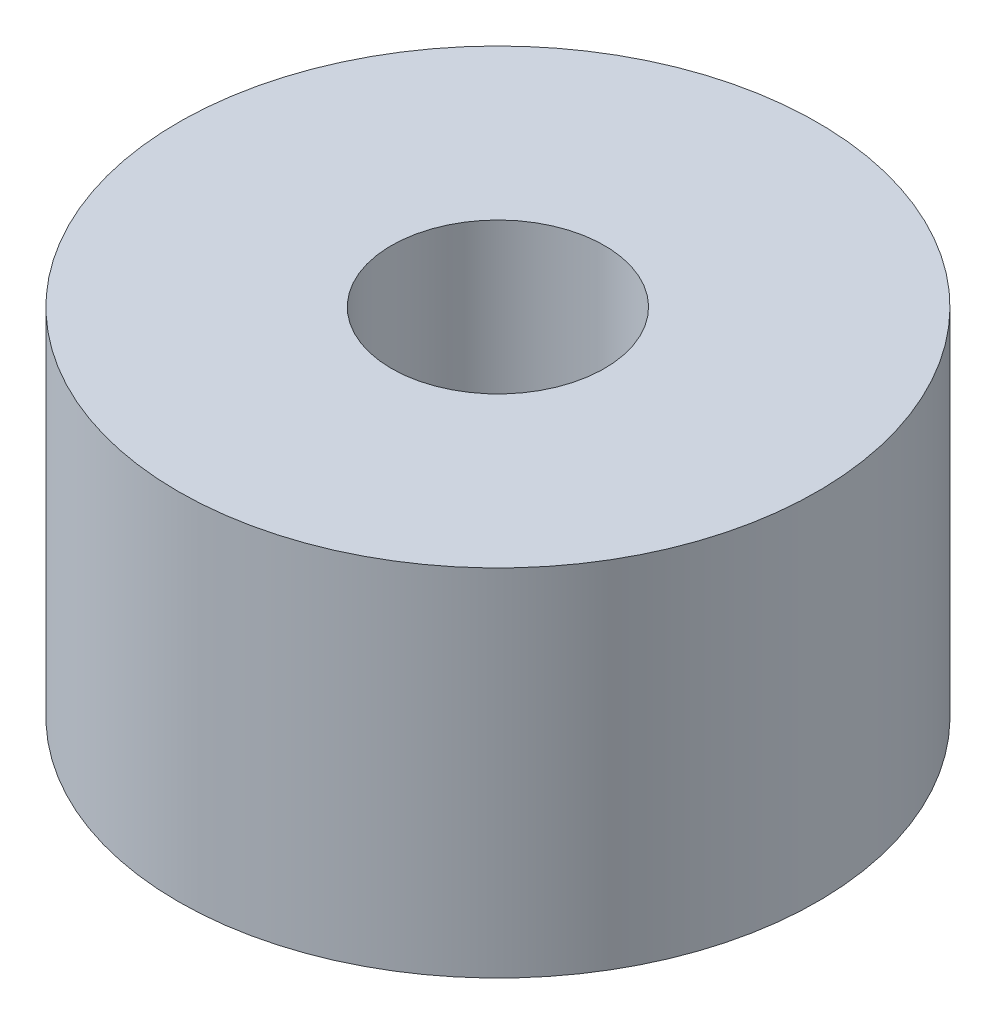
ISO-10303-21;
HEADER;
FILE_DESCRIPTION(('STEP AP214'),'2;1');
FILE_NAME('part.step','',(''),(''),'','','');
FILE_SCHEMA(('AUTOMOTIVE_DESIGN { 1 0 10303 214 1 1 1 1 }'));
ENDSEC;
DATA;
#1=APPLICATION_CONTEXT('core data for automotive mechanical design processes');
#2=APPLICATION_PROTOCOL_DEFINITION('international standard','automotive_design',2000,#1);
#3=PRODUCT_CONTEXT('',#1,'mechanical');
#4=PRODUCT('Part','Part','',(#3));
#5=PRODUCT_RELATED_PRODUCT_CATEGORY('part','',(#4));
#6=PRODUCT_DEFINITION_FORMATION('','',#4);
#7=PRODUCT_DEFINITION_CONTEXT('part definition',#1,'design');
#8=PRODUCT_DEFINITION('design','',#6,#7);
#9=PRODUCT_DEFINITION_SHAPE('','',#8);
#10=(LENGTH_UNIT() NAMED_UNIT(*) SI_UNIT(.MILLI.,.METRE.));
#11=(NAMED_UNIT(*) PLANE_ANGLE_UNIT() SI_UNIT($,.RADIAN.));
#12=(NAMED_UNIT(*) SI_UNIT($,.STERADIAN.) SOLID_ANGLE_UNIT());
#13=UNCERTAINTY_MEASURE_WITH_UNIT(LENGTH_MEASURE(1.E-05),#10,'distance_accuracy_value','');
#14=(GEOMETRIC_REPRESENTATION_CONTEXT(3) GLOBAL_UNCERTAINTY_ASSIGNED_CONTEXT((#13)) GLOBAL_UNIT_ASSIGNED_CONTEXT((#10,
#11,#12)) REPRESENTATION_CONTEXT('',''));
#15=CARTESIAN_POINT('',(0.,0.,0.));
#16=DIRECTION('',(0.,0.,1.));
#17=DIRECTION('',(1.,0.,0.));
#18=AXIS2_PLACEMENT_3D('',#15,#16,#17);
#19=CARTESIAN_POINT('',(0.,5.,0.));
#20=DIRECTION('',(0.,1.,0.));
#21=DIRECTION('',(0.,0.,1.));
#22=AXIS2_PLACEMENT_3D('',#19,#20,#21);
#23=PLANE('',#22);
#24=CARTESIAN_POINT('',(0.,5.,0.));
#25=DIRECTION('',(0.,1.,0.));
#26=DIRECTION('',(0.,0.,1.));
#27=AXIS2_PLACEMENT_3D('',#24,#25,#26);
#28=CIRCLE('',#27,4.5);
#29=CARTESIAN_POINT('',(0.,5.,4.5));
#30=VERTEX_POINT('',#29);
#31=EDGE_CURVE('E10',#30,#30,#28,.T.);
#32=ORIENTED_EDGE('',*,*,#31,.T.);
#33=EDGE_LOOP('',(#32));
#34=FACE_BOUND('',#33,.T.);
#35=CARTESIAN_POINT('',(0.,5.,0.));
#36=DIRECTION('',(0.,1.,0.));
#37=DIRECTION('',(0.,0.,1.));
#38=AXIS2_PLACEMENT_3D('',#35,#36,#37);
#39=CIRCLE('',#38,1.5);
#40=CARTESIAN_POINT('',(0.,5.,1.5));
#41=VERTEX_POINT('',#40);
#42=EDGE_CURVE('E49',#41,#41,#39,.T.);
#43=ORIENTED_EDGE('',*,*,#42,.F.);
#44=EDGE_LOOP('',(#43));
#45=FACE_BOUND('',#44,.T.);
#46=ADVANCED_FACE('F34',(#34,#45),#23,.T.);
#47=CARTESIAN_POINT('',(0.,0.,0.));
#48=DIRECTION('',(0.,1.,0.));
#49=DIRECTION('',(0.,0.,1.));
#50=AXIS2_PLACEMENT_3D('',#47,#48,#49);
#51=PLANE('',#50);
#52=CARTESIAN_POINT('',(0.,0.,0.));
#53=DIRECTION('',(0.,1.,0.));
#54=DIRECTION('',(0.,0.,1.));
#55=AXIS2_PLACEMENT_3D('',#52,#53,#54);
#56=CIRCLE('',#55,4.5);
#57=CARTESIAN_POINT('',(0.,0.,4.5));
#58=VERTEX_POINT('',#57);
#59=EDGE_CURVE('E38',#58,#58,#56,.T.);
#60=ORIENTED_EDGE('',*,*,#59,.F.);
#61=EDGE_LOOP('',(#60));
#62=FACE_BOUND('',#61,.T.);
#63=CARTESIAN_POINT('',(0.,0.,0.));
#64=DIRECTION('',(0.,1.,0.));
#65=DIRECTION('',(0.,0.,1.));
#66=AXIS2_PLACEMENT_3D('',#63,#64,#65);
#67=CIRCLE('',#66,1.5);
#68=CARTESIAN_POINT('',(0.,0.,1.5));
#69=VERTEX_POINT('',#68);
#70=EDGE_CURVE('E51',#69,#69,#67,.T.);
#71=ORIENTED_EDGE('',*,*,#70,.T.);
#72=EDGE_LOOP('',(#71));
#73=FACE_BOUND('',#72,.T.);
#74=ADVANCED_FACE('F61',(#62,#73),#51,.F.);
#75=CARTESIAN_POINT('',(0.,5.,0.));
#76=DIRECTION('',(0.,-1.,0.));
#77=DIRECTION('',(0.,0.,-1.));
#78=AXIS2_PLACEMENT_3D('',#75,#76,#77);
#79=CYLINDRICAL_SURFACE('',#78,4.5);
#80=ORIENTED_EDGE('',*,*,#31,.F.);
#81=EDGE_LOOP('',(#80));
#82=FACE_BOUND('',#81,.T.);
#83=ORIENTED_EDGE('',*,*,#59,.T.);
#84=EDGE_LOOP('',(#83));
#85=FACE_BOUND('',#84,.T.);
#86=ADVANCED_FACE('F36',(#82,#85),#79,.T.);
#87=CARTESIAN_POINT('',(0.,5.,0.));
#88=DIRECTION('',(0.,-1.,0.));
#89=DIRECTION('',(0.,0.,-1.));
#90=AXIS2_PLACEMENT_3D('',#87,#88,#89);
#91=CYLINDRICAL_SURFACE('',#90,1.5);
#92=ORIENTED_EDGE('',*,*,#42,.T.);
#93=EDGE_LOOP('',(#92));
#94=FACE_BOUND('',#93,.T.);
#95=ORIENTED_EDGE('',*,*,#70,.F.);
#96=EDGE_LOOP('',(#95));
#97=FACE_BOUND('',#96,.T.);
#98=ADVANCED_FACE('F57',(#94,#97),#91,.F.);
#99=CLOSED_SHELL('',(#46,#74,#86,#98));
#100=MANIFOLD_SOLID_BREP('B2',#99);
#101=ADVANCED_BREP_SHAPE_REPRESENTATION('',(#18,#100),#14);
#102=SHAPE_DEFINITION_REPRESENTATION(#9,#101);
ENDSEC;
END-ISO-10303-21;
